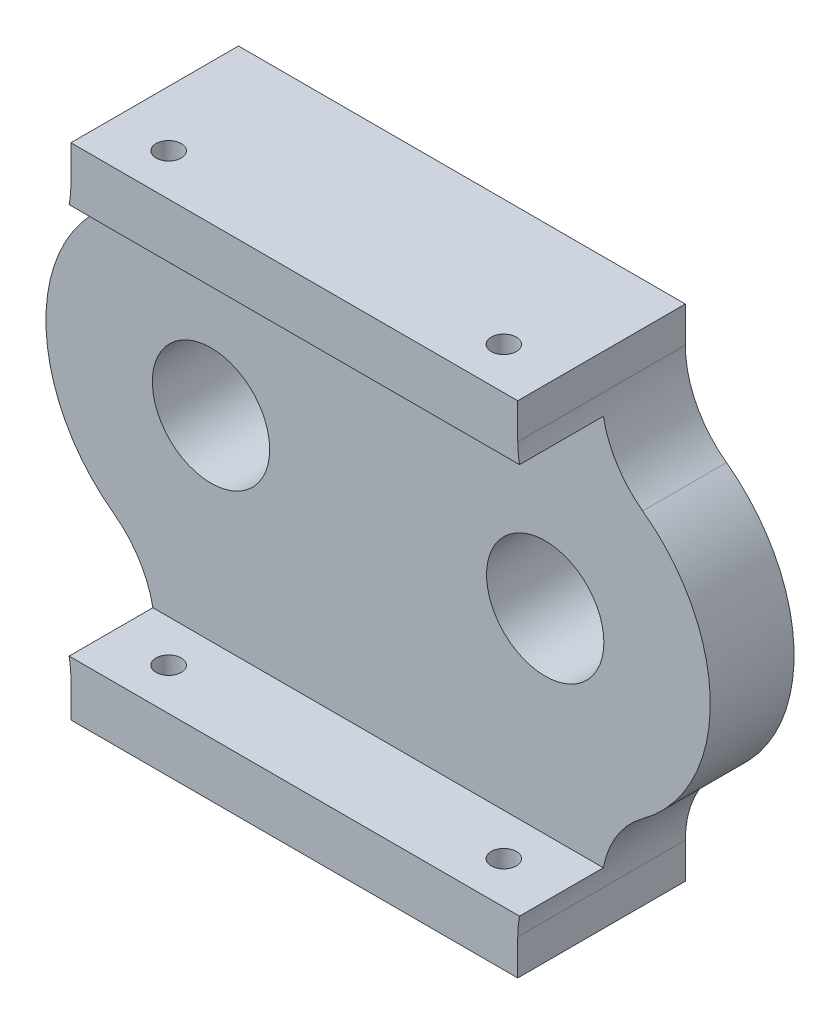
ISO-10303-21;
HEADER;
FILE_DESCRIPTION(('STEP AP214'),'2;1');
FILE_NAME('part.step','',(''),(''),'','','');
FILE_SCHEMA(('AUTOMOTIVE_DESIGN { 1 0 10303 214 1 1 1 1 }'));
ENDSEC;
DATA;
#1=APPLICATION_CONTEXT('core data for automotive mechanical design processes');
#2=APPLICATION_PROTOCOL_DEFINITION('international standard','automotive_design',2000,#1);
#3=PRODUCT_CONTEXT('',#1,'mechanical');
#4=PRODUCT('Part','Part','',(#3));
#5=PRODUCT_RELATED_PRODUCT_CATEGORY('part','',(#4));
#6=PRODUCT_DEFINITION_FORMATION('','',#4);
#7=PRODUCT_DEFINITION_CONTEXT('part definition',#1,'design');
#8=PRODUCT_DEFINITION('design','',#6,#7);
#9=PRODUCT_DEFINITION_SHAPE('','',#8);
#10=(LENGTH_UNIT() NAMED_UNIT(*) SI_UNIT(.MILLI.,.METRE.));
#11=(NAMED_UNIT(*) PLANE_ANGLE_UNIT() SI_UNIT($,.RADIAN.));
#12=(NAMED_UNIT(*) SI_UNIT($,.STERADIAN.) SOLID_ANGLE_UNIT());
#13=UNCERTAINTY_MEASURE_WITH_UNIT(LENGTH_MEASURE(1.E-05),#10,'distance_accuracy_value','');
#14=(GEOMETRIC_REPRESENTATION_CONTEXT(3) GLOBAL_UNCERTAINTY_ASSIGNED_CONTEXT((#13)) GLOBAL_UNIT_ASSIGNED_CONTEXT((#10,
#11,#12)) REPRESENTATION_CONTEXT('',''));
#15=CARTESIAN_POINT('',(0.,0.,0.));
#16=DIRECTION('',(0.,0.,1.));
#17=DIRECTION('',(1.,0.,0.));
#18=AXIS2_PLACEMENT_3D('',#15,#16,#17);
#19=CARTESIAN_POINT('',(-29.9162885534734,0.000305589560917769,15.));
#20=DIRECTION('',(0.,0.,-1.));
#21=DIRECTION('',(-1.,0.,0.));
#22=AXIS2_PLACEMENT_3D('',#19,#20,#21);
#23=CYLINDRICAL_SURFACE('',#22,10.4999999999879);
#24=CARTESIAN_POINT('',(-29.9162885534734,0.000305589560917769,15.));
#25=DIRECTION('',(0.,0.,1.));
#26=DIRECTION('',(1.,0.,0.));
#27=AXIS2_PLACEMENT_3D('',#24,#25,#26);
#28=CIRCLE('',#27,10.4999999999879);
#29=CARTESIAN_POINT('',(-19.4162885534855,0.000305589560917769,15.));
#30=VERTEX_POINT('',#29);
#31=EDGE_CURVE('E225',#30,#30,#28,.T.);
#32=ORIENTED_EDGE('',*,*,#31,.T.);
#33=EDGE_LOOP('',(#32));
#34=FACE_BOUND('',#33,.T.);
#35=CARTESIAN_POINT('',(-29.9162885534734,0.000305589560917769,0.));
#36=DIRECTION('',(0.,0.,1.));
#37=DIRECTION('',(1.,0.,0.));
#38=AXIS2_PLACEMENT_3D('',#35,#36,#37);
#39=CIRCLE('',#38,10.4999999999879);
#40=CARTESIAN_POINT('',(-19.4162885534855,0.000305589560917769,0.));
#41=VERTEX_POINT('',#40);
#42=EDGE_CURVE('E249',#41,#41,#39,.T.);
#43=ORIENTED_EDGE('',*,*,#42,.F.);
#44=EDGE_LOOP('',(#43));
#45=FACE_BOUND('',#44,.T.);
#46=ADVANCED_FACE('F134',(#34,#45),#23,.F.);
#47=CARTESIAN_POINT('',(-58.0000000000002,38.3771628916933,15.));
#48=DIRECTION('',(0.,0.,-1.));
#49=DIRECTION('',(-1.,0.,0.));
#50=AXIS2_PLACEMENT_3D('',#47,#48,#49);
#51=CYLINDRICAL_SURFACE('',#50,18.);
#52=CARTESIAN_POINT('',(-58.0000000000002,38.3771628916933,0.));
#53=DIRECTION('',(0.,0.,1.));
#54=DIRECTION('',(1.,0.,0.));
#55=AXIS2_PLACEMENT_3D('',#52,#53,#54);
#56=CIRCLE('',#55,18.);
#57=CARTESIAN_POINT('',(-47.370059803649,23.8511733755881,0.));
#58=VERTEX_POINT('',#57);
#59=CARTESIAN_POINT('',(-40.,38.3771628916932,0.));
#60=VERTEX_POINT('',#59);
#61=EDGE_CURVE('E234',#58,#60,#56,.T.);
#62=ORIENTED_EDGE('',*,*,#61,.F.);
#63=DIRECTION('',(0.,0.,-1.));
#64=VECTOR('',#63,1.);
#65=CARTESIAN_POINT('',(-47.370059803649,23.8511733755881,15.));
#66=LINE('',#65,#64);
#67=CARTESIAN_POINT('',(-47.370059803649,23.8511733755881,15.));
#68=VERTEX_POINT('',#67);
#69=EDGE_CURVE('E12',#68,#58,#66,.T.);
#70=ORIENTED_EDGE('',*,*,#69,.F.);
#71=CARTESIAN_POINT('',(-58.0000000000002,38.3771628916933,15.));
#72=DIRECTION('',(0.,0.,1.));
#73=DIRECTION('',(1.,0.,0.));
#74=AXIS2_PLACEMENT_3D('',#71,#72,#73);
#75=CIRCLE('',#74,18.);
#76=CARTESIAN_POINT('',(-40.3196501504358,35.0000000000036,15.));
#77=VERTEX_POINT('',#76);
#78=EDGE_CURVE('E366',#68,#77,#75,.T.);
#79=ORIENTED_EDGE('',*,*,#78,.T.);
#80=DIRECTION('',(0.,0.,-1.));
#81=VECTOR('',#80,1.);
#82=CARTESIAN_POINT('',(-40.3196501504358,35.0000000000036,30.));
#83=LINE('',#82,#81);
#84=CARTESIAN_POINT('',(-40.3196501504358,35.0000000000036,30.));
#85=VERTEX_POINT('',#84);
#86=EDGE_CURVE('E184',#85,#77,#83,.T.);
#87=ORIENTED_EDGE('',*,*,#86,.F.);
#88=CARTESIAN_POINT('',(-58.0000000000001,38.3771628916932,30.));
#89=DIRECTION('',(0.,0.,1.));
#90=DIRECTION('',(1.,0.,0.));
#91=AXIS2_PLACEMENT_3D('',#88,#89,#90);
#92=CIRCLE('',#91,18.0000000000001);
#93=CARTESIAN_POINT('',(-40.,38.3771628916932,30.));
#94=VERTEX_POINT('',#93);
#95=EDGE_CURVE('E322',#85,#94,#92,.T.);
#96=ORIENTED_EDGE('',*,*,#95,.T.);
#97=DIRECTION('',(0.,0.,-1.));
#98=VECTOR('',#97,1.);
#99=CARTESIAN_POINT('',(-40.,38.3771628916932,30.));
#100=LINE('',#99,#98);
#101=EDGE_CURVE('E340',#94,#60,#100,.T.);
#102=ORIENTED_EDGE('',*,*,#101,.T.);
#103=EDGE_LOOP('',(#62,#70,#79,#87,#96,#102));
#104=FACE_BOUND('',#103,.T.);
#105=ADVANCED_FACE('F429',(#104),#51,.F.);
#106=CARTESIAN_POINT('',(-29.9162885534735,0.000305589560940835,15.));
#107=DIRECTION('',(0.,0.,-1.));
#108=DIRECTION('',(-1.,0.,0.));
#109=AXIS2_PLACEMENT_3D('',#106,#107,#108);
#110=CYLINDRICAL_SURFACE('',#109,29.555);
#111=CARTESIAN_POINT('',(-29.9162885534735,0.000305589560940835,0.));
#112=DIRECTION('',(0.,0.,1.));
#113=DIRECTION('',(1.,0.,0.));
#114=AXIS2_PLACEMENT_3D('',#111,#112,#113);
#115=CIRCLE('',#114,29.555);
#116=CARTESIAN_POINT('',(-47.370059803649,-23.8505621964662,0.));
#117=VERTEX_POINT('',#116);
#118=EDGE_CURVE('E238',#58,#117,#115,.T.);
#119=ORIENTED_EDGE('',*,*,#118,.T.);
#120=DIRECTION('',(0.,0.,-1.));
#121=VECTOR('',#120,1.);
#122=CARTESIAN_POINT('',(-47.370059803649,-23.8505621964662,15.));
#123=LINE('',#122,#121);
#124=CARTESIAN_POINT('',(-47.370059803649,-23.8505621964662,15.));
#125=VERTEX_POINT('',#124);
#126=EDGE_CURVE('E144',#125,#117,#123,.T.);
#127=ORIENTED_EDGE('',*,*,#126,.F.);
#128=CARTESIAN_POINT('',(-29.9162885534735,0.000305589560940835,15.));
#129=DIRECTION('',(0.,0.,1.));
#130=DIRECTION('',(1.,0.,0.));
#131=AXIS2_PLACEMENT_3D('',#128,#129,#130);
#132=CIRCLE('',#131,29.555);
#133=EDGE_CURVE('E369',#68,#125,#132,.T.);
#134=ORIENTED_EDGE('',*,*,#133,.F.);
#135=ORIENTED_EDGE('',*,*,#69,.T.);
#136=EDGE_LOOP('',(#119,#127,#134,#135));
#137=FACE_BOUND('',#136,.T.);
#138=ADVANCED_FACE('F452',(#137),#110,.T.);
#139=CARTESIAN_POINT('',(-58.0000000000002,-38.3765517125714,15.));
#140=DIRECTION('',(0.,0.,-1.));
#141=DIRECTION('',(-1.,0.,0.));
#142=AXIS2_PLACEMENT_3D('',#139,#140,#141);
#143=CYLINDRICAL_SURFACE('',#142,18.);
#144=CARTESIAN_POINT('',(-58.0000000000002,-38.3765517125714,0.));
#145=DIRECTION('',(0.,0.,1.));
#146=DIRECTION('',(1.,0.,0.));
#147=AXIS2_PLACEMENT_3D('',#144,#145,#146);
#148=CIRCLE('',#147,18.);
#149=CARTESIAN_POINT('',(-40.0000000000001,-38.3765517125714,0.));
#150=VERTEX_POINT('',#149);
#151=EDGE_CURVE('E241',#150,#117,#148,.T.);
#152=ORIENTED_EDGE('',*,*,#151,.F.);
#153=DIRECTION('',(0.,0.,-1.));
#154=VECTOR('',#153,1.);
#155=CARTESIAN_POINT('',(-40.0000000000001,-38.3765517125714,30.));
#156=LINE('',#155,#154);
#157=CARTESIAN_POINT('',(-40.0000000000001,-38.3765517125714,30.));
#158=VERTEX_POINT('',#157);
#159=EDGE_CURVE('E318',#158,#150,#156,.T.);
#160=ORIENTED_EDGE('',*,*,#159,.F.);
#161=CARTESIAN_POINT('',(-58.0000000000001,-38.3765517125714,30.));
#162=DIRECTION('',(0.,0.,1.));
#163=DIRECTION('',(1.,0.,0.));
#164=AXIS2_PLACEMENT_3D('',#161,#162,#163);
#165=CIRCLE('',#164,18.);
#166=CARTESIAN_POINT('',(-40.3195334187048,-34.9999999999958,30.));
#167=VERTEX_POINT('',#166);
#168=EDGE_CURVE('E290',#158,#167,#165,.T.);
#169=ORIENTED_EDGE('',*,*,#168,.T.);
#170=DIRECTION('',(0.,0.,-1.));
#171=VECTOR('',#170,1.);
#172=CARTESIAN_POINT('',(-40.3195334187048,-34.9999999999958,30.));
#173=LINE('',#172,#171);
#174=CARTESIAN_POINT('',(-40.3195334187048,-34.9999999999958,15.));
#175=VERTEX_POINT('',#174);
#176=EDGE_CURVE('E213',#167,#175,#173,.T.);
#177=ORIENTED_EDGE('',*,*,#176,.T.);
#178=CARTESIAN_POINT('',(-58.0000000000002,-38.3765517125714,15.));
#179=DIRECTION('',(0.,0.,1.));
#180=DIRECTION('',(1.,0.,0.));
#181=AXIS2_PLACEMENT_3D('',#178,#179,#180);
#182=CIRCLE('',#181,18.);
#183=EDGE_CURVE('E220',#175,#125,#182,.T.);
#184=ORIENTED_EDGE('',*,*,#183,.T.);
#185=ORIENTED_EDGE('',*,*,#126,.T.);
#186=EDGE_LOOP('',(#152,#160,#169,#177,#184,#185));
#187=FACE_BOUND('',#186,.T.);
#188=ADVANCED_FACE('F372',(#187),#143,.F.);
#189=CARTESIAN_POINT('',(57.9999999999998,-38.3765517125713,15.));
#190=DIRECTION('',(0.,0.,-1.));
#191=DIRECTION('',(-1.,0.,0.));
#192=AXIS2_PLACEMENT_3D('',#189,#190,#191);
#193=CYLINDRICAL_SURFACE('',#192,18.);
#194=CARTESIAN_POINT('',(57.9999999999998,-38.3765517125713,0.));
#195=DIRECTION('',(0.,0.,1.));
#196=DIRECTION('',(1.,0.,0.));
#197=AXIS2_PLACEMENT_3D('',#194,#195,#196);
#198=CIRCLE('',#197,18.);
#199=CARTESIAN_POINT('',(47.3700598036488,-23.8505621964662,0.));
#200=VERTEX_POINT('',#199);
#201=CARTESIAN_POINT('',(39.9999999999999,-38.3765517125714,0.));
#202=VERTEX_POINT('',#201);
#203=EDGE_CURVE('E244',#200,#202,#198,.T.);
#204=ORIENTED_EDGE('',*,*,#203,.F.);
#205=DIRECTION('',(0.,0.,-1.));
#206=VECTOR('',#205,1.);
#207=CARTESIAN_POINT('',(47.3700598036488,-23.8505621964662,15.));
#208=LINE('',#207,#206);
#209=CARTESIAN_POINT('',(47.3700598036488,-23.8505621964662,15.));
#210=VERTEX_POINT('',#209);
#211=EDGE_CURVE('E169',#210,#200,#208,.T.);
#212=ORIENTED_EDGE('',*,*,#211,.F.);
#213=CARTESIAN_POINT('',(57.9999999999998,-38.3765517125713,15.));
#214=DIRECTION('',(0.,0.,1.));
#215=DIRECTION('',(1.,0.,0.));
#216=AXIS2_PLACEMENT_3D('',#213,#214,#215);
#217=CIRCLE('',#216,18.);
#218=CARTESIAN_POINT('',(40.3195334187044,-34.9999999999964,15.));
#219=VERTEX_POINT('',#218);
#220=EDGE_CURVE('E218',#210,#219,#217,.T.);
#221=ORIENTED_EDGE('',*,*,#220,.T.);
#222=DIRECTION('',(0.,0.,-1.));
#223=VECTOR('',#222,1.);
#224=CARTESIAN_POINT('',(40.3195334187044,-34.9999999999964,30.));
#225=LINE('',#224,#223);
#226=CARTESIAN_POINT('',(40.3195334187044,-34.9999999999964,30.));
#227=VERTEX_POINT('',#226);
#228=EDGE_CURVE('E198',#227,#219,#225,.T.);
#229=ORIENTED_EDGE('',*,*,#228,.F.);
#230=CARTESIAN_POINT('',(58.,-38.3765517125714,30.));
#231=DIRECTION('',(0.,0.,1.));
#232=DIRECTION('',(1.,0.,0.));
#233=AXIS2_PLACEMENT_3D('',#230,#231,#232);
#234=CIRCLE('',#233,18.0000000000001);
#235=CARTESIAN_POINT('',(39.9999999999999,-38.3765517125714,30.));
#236=VERTEX_POINT('',#235);
#237=EDGE_CURVE('E286',#227,#236,#234,.T.);
#238=ORIENTED_EDGE('',*,*,#237,.T.);
#239=DIRECTION('',(0.,0.,-1.));
#240=VECTOR('',#239,1.);
#241=CARTESIAN_POINT('',(39.9999999999999,-38.3765517125714,30.));
#242=LINE('',#241,#240);
#243=EDGE_CURVE('E302',#236,#202,#242,.T.);
#244=ORIENTED_EDGE('',*,*,#243,.T.);
#245=EDGE_LOOP('',(#204,#212,#221,#229,#238,#244));
#246=FACE_BOUND('',#245,.T.);
#247=ADVANCED_FACE('F223',(#246),#193,.F.);
#248=CARTESIAN_POINT('',(29.9162885534731,0.000305589560940835,15.));
#249=DIRECTION('',(0.,0.,-1.));
#250=DIRECTION('',(-1.,0.,0.));
#251=AXIS2_PLACEMENT_3D('',#248,#249,#250);
#252=CYLINDRICAL_SURFACE('',#251,29.5550000000002);
#253=CARTESIAN_POINT('',(29.9162885534731,0.000305589560940835,0.));
#254=DIRECTION('',(0.,0.,1.));
#255=DIRECTION('',(1.,0.,0.));
#256=AXIS2_PLACEMENT_3D('',#253,#254,#255);
#257=CIRCLE('',#256,29.5550000000002);
#258=CARTESIAN_POINT('',(47.3700598036488,23.8511733755882,0.));
#259=VERTEX_POINT('',#258);
#260=EDGE_CURVE('E247',#200,#259,#257,.T.);
#261=ORIENTED_EDGE('',*,*,#260,.T.);
#262=DIRECTION('',(0.,0.,-1.));
#263=VECTOR('',#262,1.);
#264=CARTESIAN_POINT('',(47.3700598036488,23.8511733755882,15.));
#265=LINE('',#264,#263);
#266=CARTESIAN_POINT('',(47.3700598036488,23.8511733755882,15.));
#267=VERTEX_POINT('',#266);
#268=EDGE_CURVE('E176',#267,#259,#265,.T.);
#269=ORIENTED_EDGE('',*,*,#268,.F.);
#270=CARTESIAN_POINT('',(29.9162885534731,0.000305589560940835,15.));
#271=DIRECTION('',(0.,0.,1.));
#272=DIRECTION('',(1.,0.,0.));
#273=AXIS2_PLACEMENT_3D('',#270,#271,#272);
#274=CIRCLE('',#273,29.5550000000002);
#275=EDGE_CURVE('E153',#210,#267,#274,.T.);
#276=ORIENTED_EDGE('',*,*,#275,.F.);
#277=ORIENTED_EDGE('',*,*,#211,.T.);
#278=EDGE_LOOP('',(#261,#269,#276,#277));
#279=FACE_BOUND('',#278,.T.);
#280=ADVANCED_FACE('F467',(#279),#252,.T.);
#281=CARTESIAN_POINT('',(58.0000000000003,38.3771628916933,15.));
#282=DIRECTION('',(0.,0.,-1.));
#283=DIRECTION('',(-1.,0.,0.));
#284=AXIS2_PLACEMENT_3D('',#281,#282,#283);
#285=CYLINDRICAL_SURFACE('',#284,18.0000000000003);
#286=CARTESIAN_POINT('',(58.0000000000003,38.3771628916933,0.));
#287=DIRECTION('',(0.,0.,1.));
#288=DIRECTION('',(1.,0.,0.));
#289=AXIS2_PLACEMENT_3D('',#286,#287,#288);
#290=CIRCLE('',#289,18.0000000000003);
#291=CARTESIAN_POINT('',(39.9999999999998,38.3771628916932,0.));
#292=VERTEX_POINT('',#291);
#293=EDGE_CURVE('E231',#292,#259,#290,.T.);
#294=ORIENTED_EDGE('',*,*,#293,.F.);
#295=DIRECTION('',(0.,0.,-1.));
#296=VECTOR('',#295,1.);
#297=CARTESIAN_POINT('',(39.9999999999998,38.3771628916932,30.));
#298=LINE('',#297,#296);
#299=CARTESIAN_POINT('',(39.9999999999998,38.3771628916932,30.));
#300=VERTEX_POINT('',#299);
#301=EDGE_CURVE('E356',#300,#292,#298,.T.);
#302=ORIENTED_EDGE('',*,*,#301,.F.);
#303=CARTESIAN_POINT('',(58.,38.3771628916932,30.));
#304=DIRECTION('',(0.,0.,1.));
#305=DIRECTION('',(1.,0.,0.));
#306=AXIS2_PLACEMENT_3D('',#303,#304,#305);
#307=CIRCLE('',#306,18.0000000000001);
#308=CARTESIAN_POINT('',(40.3196501504353,35.0000000000042,30.));
#309=VERTEX_POINT('',#308);
#310=EDGE_CURVE('E328',#300,#309,#307,.T.);
#311=ORIENTED_EDGE('',*,*,#310,.T.);
#312=DIRECTION('',(0.,0.,-1.));
#313=VECTOR('',#312,1.);
#314=CARTESIAN_POINT('',(40.3196501504353,35.0000000000042,30.));
#315=LINE('',#314,#313);
#316=CARTESIAN_POINT('',(40.3196501504353,35.0000000000042,15.));
#317=VERTEX_POINT('',#316);
#318=EDGE_CURVE('E359',#309,#317,#315,.T.);
#319=ORIENTED_EDGE('',*,*,#318,.T.);
#320=CARTESIAN_POINT('',(58.0000000000003,38.3771628916933,15.));
#321=DIRECTION('',(0.,0.,1.));
#322=DIRECTION('',(1.,0.,0.));
#323=AXIS2_PLACEMENT_3D('',#320,#321,#322);
#324=CIRCLE('',#323,18.0000000000003);
#325=EDGE_CURVE('E252',#317,#267,#324,.T.);
#326=ORIENTED_EDGE('',*,*,#325,.T.);
#327=ORIENTED_EDGE('',*,*,#268,.T.);
#328=EDGE_LOOP('',(#294,#302,#311,#319,#326,#327));
#329=FACE_BOUND('',#328,.T.);
#330=ADVANCED_FACE('F444',(#329),#285,.F.);
#331=CARTESIAN_POINT('',(0.,0.,0.));
#332=DIRECTION('',(0.,0.,1.));
#333=DIRECTION('',(1.,0.,0.));
#334=AXIS2_PLACEMENT_3D('',#331,#332,#333);
#335=PLANE('',#334);
#336=ORIENTED_EDGE('',*,*,#293,.T.);
#337=ORIENTED_EDGE('',*,*,#260,.F.);
#338=ORIENTED_EDGE('',*,*,#203,.T.);
#339=DIRECTION('',(0.,1.,0.));
#340=VECTOR('',#339,1.);
#341=CARTESIAN_POINT('',(39.9999999999999,0.,0.));
#342=LINE('',#341,#340);
#343=CARTESIAN_POINT('',(39.9999999999999,-44.75,0.));
#344=VERTEX_POINT('',#343);
#345=EDGE_CURVE('E288',#344,#202,#342,.T.);
#346=ORIENTED_EDGE('',*,*,#345,.F.);
#347=DIRECTION('',(1.,0.,0.));
#348=VECTOR('',#347,1.);
#349=CARTESIAN_POINT('',(0.,-44.75,0.));
#350=LINE('',#349,#348);
#351=CARTESIAN_POINT('',(-40.0000000000001,-44.75,0.));
#352=VERTEX_POINT('',#351);
#353=EDGE_CURVE('E305',#352,#344,#350,.T.);
#354=ORIENTED_EDGE('',*,*,#353,.F.);
#355=DIRECTION('',(0.,-1.,0.));
#356=VECTOR('',#355,1.);
#357=CARTESIAN_POINT('',(-40.,1.30646273558267E-13,0.));
#358=LINE('',#357,#356);
#359=EDGE_CURVE('E285',#150,#352,#358,.T.);
#360=ORIENTED_EDGE('',*,*,#359,.F.);
#361=ORIENTED_EDGE('',*,*,#151,.T.);
#362=ORIENTED_EDGE('',*,*,#118,.F.);
#363=ORIENTED_EDGE('',*,*,#61,.T.);
#364=DIRECTION('',(0.,-1.,0.));
#365=VECTOR('',#364,1.);
#366=CARTESIAN_POINT('',(-40.,0.,0.));
#367=LINE('',#366,#365);
#368=CARTESIAN_POINT('',(-40.,44.75,0.));
#369=VERTEX_POINT('',#368);
#370=EDGE_CURVE('E326',#369,#60,#367,.T.);
#371=ORIENTED_EDGE('',*,*,#370,.F.);
#372=DIRECTION('',(-1.,0.,0.));
#373=VECTOR('',#372,1.);
#374=CARTESIAN_POINT('',(0.,44.75,0.));
#375=LINE('',#374,#373);
#376=CARTESIAN_POINT('',(39.9999999999998,44.75,0.));
#377=VERTEX_POINT('',#376);
#378=EDGE_CURVE('E343',#377,#369,#375,.T.);
#379=ORIENTED_EDGE('',*,*,#378,.F.);
#380=DIRECTION('',(0.,1.,0.));
#381=VECTOR('',#380,1.);
#382=CARTESIAN_POINT('',(39.9999999999998,0.,0.));
#383=LINE('',#382,#381);
#384=EDGE_CURVE('E212',#292,#377,#383,.T.);
#385=ORIENTED_EDGE('',*,*,#384,.F.);
#386=EDGE_LOOP('',(#336,#337,#338,#346,#354,#360,#361,#362,#363,#371,#379,#385));
#387=FACE_BOUND('',#386,.T.);
#388=ORIENTED_EDGE('',*,*,#42,.T.);
#389=EDGE_LOOP('',(#388));
#390=FACE_BOUND('',#389,.T.);
#391=CARTESIAN_POINT('',(29.9162885534732,0.000305589560917769,0.));
#392=DIRECTION('',(0.,0.,1.));
#393=DIRECTION('',(1.,0.,0.));
#394=AXIS2_PLACEMENT_3D('',#391,#392,#393);
#395=CIRCLE('',#394,10.4999999999975);
#396=CARTESIAN_POINT('',(40.4162885534707,0.000305589560917769,0.));
#397=VERTEX_POINT('',#396);
#398=EDGE_CURVE('E258',#397,#397,#395,.T.);
#399=ORIENTED_EDGE('',*,*,#398,.T.);
#400=EDGE_LOOP('',(#399));
#401=FACE_BOUND('',#400,.T.);
#402=ADVANCED_FACE('F424',(#387,#390,#401),#335,.F.);
#403=CARTESIAN_POINT('',(0.,0.,15.));
#404=DIRECTION('',(0.,0.,1.));
#405=DIRECTION('',(1.,0.,0.));
#406=AXIS2_PLACEMENT_3D('',#403,#404,#405);
#407=PLANE('',#406);
#408=ORIENTED_EDGE('',*,*,#325,.F.);
#409=DIRECTION('',(-1.,0.,0.));
#410=VECTOR('',#409,1.);
#411=CARTESIAN_POINT('',(-2.59006099666486E-13,35.0000000000039,15.));
#412=LINE('',#411,#410);
#413=EDGE_CURVE('E364',#317,#77,#412,.T.);
#414=ORIENTED_EDGE('',*,*,#413,.T.);
#415=ORIENTED_EDGE('',*,*,#78,.F.);
#416=ORIENTED_EDGE('',*,*,#133,.T.);
#417=ORIENTED_EDGE('',*,*,#183,.F.);
#418=DIRECTION('',(1.,0.,0.));
#419=VECTOR('',#418,1.);
#420=CARTESIAN_POINT('',(-2.62018557084706E-13,-34.9999999999961,15.));
#421=LINE('',#420,#419);
#422=EDGE_CURVE('E203',#175,#219,#421,.T.);
#423=ORIENTED_EDGE('',*,*,#422,.T.);
#424=ORIENTED_EDGE('',*,*,#220,.F.);
#425=ORIENTED_EDGE('',*,*,#275,.T.);
#426=EDGE_LOOP('',(#408,#414,#415,#416,#417,#423,#424,#425));
#427=FACE_BOUND('',#426,.T.);
#428=ORIENTED_EDGE('',*,*,#31,.F.);
#429=EDGE_LOOP('',(#428));
#430=FACE_BOUND('',#429,.T.);
#431=CARTESIAN_POINT('',(29.9162885534732,0.000305589560917769,15.));
#432=DIRECTION('',(0.,0.,1.));
#433=DIRECTION('',(1.,0.,0.));
#434=AXIS2_PLACEMENT_3D('',#431,#432,#433);
#435=CIRCLE('',#434,10.4999999999975);
#436=CARTESIAN_POINT('',(40.4162885534707,0.000305589560917769,15.));
#437=VERTEX_POINT('',#436);
#438=EDGE_CURVE('E235',#437,#437,#435,.T.);
#439=ORIENTED_EDGE('',*,*,#438,.F.);
#440=EDGE_LOOP('',(#439));
#441=FACE_BOUND('',#440,.T.);
#442=ADVANCED_FACE('F216',(#427,#430,#441),#407,.T.);
#443=CARTESIAN_POINT('',(29.9162885534732,0.000305589560917769,15.));
#444=DIRECTION('',(0.,0.,-1.));
#445=DIRECTION('',(-1.,0.,0.));
#446=AXIS2_PLACEMENT_3D('',#443,#444,#445);
#447=CYLINDRICAL_SURFACE('',#446,10.4999999999975);
#448=ORIENTED_EDGE('',*,*,#438,.T.);
#449=EDGE_LOOP('',(#448));
#450=FACE_BOUND('',#449,.T.);
#451=ORIENTED_EDGE('',*,*,#398,.F.);
#452=EDGE_LOOP('',(#451));
#453=FACE_BOUND('',#452,.T.);
#454=ADVANCED_FACE('F136',(#450,#453),#447,.F.);
#455=CARTESIAN_POINT('',(-2.59006099666486E-13,35.0000000000039,30.));
#456=DIRECTION('',(0.,-1.,0.));
#457=DIRECTION('',(1.,0.,0.));
#458=AXIS2_PLACEMENT_3D('',#455,#456,#457);
#459=PLANE('',#458);
#460=CARTESIAN_POINT('',(-30.0012885534735,35.0000000000037,22.5));
#461=DIRECTION('',(0.,-1.,0.));
#462=DIRECTION('',(1.,0.,0.));
#463=AXIS2_PLACEMENT_3D('',#460,#461,#462);
#464=CIRCLE('',#463,2.25);
#465=CARTESIAN_POINT('',(-27.7512885534735,35.0000000000037,22.5));
#466=VERTEX_POINT('',#465);
#467=EDGE_CURVE('E282',#466,#466,#464,.T.);
#468=ORIENTED_EDGE('',*,*,#467,.F.);
#469=EDGE_LOOP('',(#468));
#470=FACE_BOUND('',#469,.T.);
#471=CARTESIAN_POINT('',(30.0012885534735,35.0000000000041,22.5000000000009));
#472=DIRECTION('',(0.,-1.,0.));
#473=DIRECTION('',(1.,0.,0.));
#474=AXIS2_PLACEMENT_3D('',#471,#472,#473);
#475=CIRCLE('',#474,2.25);
#476=CARTESIAN_POINT('',(32.2512885534735,35.0000000000041,22.5000000000009));
#477=VERTEX_POINT('',#476);
#478=EDGE_CURVE('E267',#477,#477,#475,.T.);
#479=ORIENTED_EDGE('',*,*,#478,.F.);
#480=EDGE_LOOP('',(#479));
#481=FACE_BOUND('',#480,.T.);
#482=ORIENTED_EDGE('',*,*,#413,.F.);
#483=ORIENTED_EDGE('',*,*,#318,.F.);
#484=DIRECTION('',(-1.,0.,0.));
#485=VECTOR('',#484,1.);
#486=CARTESIAN_POINT('',(-2.59006099666486E-13,35.0000000000039,30.));
#487=LINE('',#486,#485);
#488=EDGE_CURVE('E325',#309,#85,#487,.T.);
#489=ORIENTED_EDGE('',*,*,#488,.T.);
#490=ORIENTED_EDGE('',*,*,#86,.T.);
#491=EDGE_LOOP('',(#482,#483,#489,#490));
#492=FACE_BOUND('',#491,.T.);
#493=ADVANCED_FACE('F448',(#470,#481,#492),#459,.T.);
#494=CARTESIAN_POINT('',(39.9999999999998,0.,30.));
#495=DIRECTION('',(-1.,0.,0.));
#496=DIRECTION('',(0.,0.,1.));
#497=AXIS2_PLACEMENT_3D('',#494,#495,#496);
#498=PLANE('',#497);
#499=ORIENTED_EDGE('',*,*,#384,.T.);
#500=DIRECTION('',(0.,0.,-1.));
#501=VECTOR('',#500,1.);
#502=CARTESIAN_POINT('',(39.9999999999998,44.75,30.));
#503=LINE('',#502,#501);
#504=CARTESIAN_POINT('',(39.9999999999998,44.75,30.));
#505=VERTEX_POINT('',#504);
#506=EDGE_CURVE('E353',#505,#377,#503,.T.);
#507=ORIENTED_EDGE('',*,*,#506,.F.);
#508=DIRECTION('',(0.,1.,0.));
#509=VECTOR('',#508,1.);
#510=CARTESIAN_POINT('',(39.9999999999998,0.,30.));
#511=LINE('',#510,#509);
#512=EDGE_CURVE('E331',#300,#505,#511,.T.);
#513=ORIENTED_EDGE('',*,*,#512,.F.);
#514=ORIENTED_EDGE('',*,*,#301,.T.);
#515=EDGE_LOOP('',(#499,#507,#513,#514));
#516=FACE_BOUND('',#515,.T.);
#517=ADVANCED_FACE('F441',(#516),#498,.F.);
#518=CARTESIAN_POINT('',(0.,44.75,30.));
#519=DIRECTION('',(0.,-1.,0.));
#520=DIRECTION('',(0.,0.,-1.));
#521=AXIS2_PLACEMENT_3D('',#518,#519,#520);
#522=PLANE('',#521);
#523=CARTESIAN_POINT('',(-30.0012885534735,44.75,22.5));
#524=DIRECTION('',(0.,-1.,0.));
#525=DIRECTION('',(0.,0.,-1.));
#526=AXIS2_PLACEMENT_3D('',#523,#524,#525);
#527=CIRCLE('',#526,2.25);
#528=CARTESIAN_POINT('',(-30.0012885534735,44.75,20.25));
#529=VERTEX_POINT('',#528);
#530=EDGE_CURVE('E263',#529,#529,#527,.T.);
#531=ORIENTED_EDGE('',*,*,#530,.T.);
#532=EDGE_LOOP('',(#531));
#533=FACE_BOUND('',#532,.T.);
#534=CARTESIAN_POINT('',(30.0012885534735,44.75,22.5000000000009));
#535=DIRECTION('',(0.,-1.,0.));
#536=DIRECTION('',(0.,0.,1.));
#537=AXIS2_PLACEMENT_3D('',#534,#535,#536);
#538=CIRCLE('',#537,2.25);
#539=CARTESIAN_POINT('',(30.0012885534735,44.75,24.7500000000009));
#540=VERTEX_POINT('',#539);
#541=EDGE_CURVE('E270',#540,#540,#538,.T.);
#542=ORIENTED_EDGE('',*,*,#541,.T.);
#543=EDGE_LOOP('',(#542));
#544=FACE_BOUND('',#543,.T.);
#545=ORIENTED_EDGE('',*,*,#378,.T.);
#546=DIRECTION('',(0.,0.,-1.));
#547=VECTOR('',#546,1.);
#548=CARTESIAN_POINT('',(-40.,44.75,30.));
#549=LINE('',#548,#547);
#550=CARTESIAN_POINT('',(-40.,44.75,30.));
#551=VERTEX_POINT('',#550);
#552=EDGE_CURVE('E350',#551,#369,#549,.T.);
#553=ORIENTED_EDGE('',*,*,#552,.F.);
#554=DIRECTION('',(-1.,0.,0.));
#555=VECTOR('',#554,1.);
#556=CARTESIAN_POINT('',(0.,44.75,30.));
#557=LINE('',#556,#555);
#558=EDGE_CURVE('E334',#505,#551,#557,.T.);
#559=ORIENTED_EDGE('',*,*,#558,.F.);
#560=ORIENTED_EDGE('',*,*,#506,.T.);
#561=EDGE_LOOP('',(#545,#553,#559,#560));
#562=FACE_BOUND('',#561,.T.);
#563=ADVANCED_FACE('F437',(#533,#544,#562),#522,.F.);
#564=CARTESIAN_POINT('',(-40.,0.,30.));
#565=DIRECTION('',(1.,0.,0.));
#566=DIRECTION('',(0.,0.,-1.));
#567=AXIS2_PLACEMENT_3D('',#564,#565,#566);
#568=PLANE('',#567);
#569=ORIENTED_EDGE('',*,*,#370,.T.);
#570=ORIENTED_EDGE('',*,*,#101,.F.);
#571=DIRECTION('',(0.,-1.,0.));
#572=VECTOR('',#571,1.);
#573=CARTESIAN_POINT('',(-40.,0.,30.));
#574=LINE('',#573,#572);
#575=EDGE_CURVE('E337',#551,#94,#574,.T.);
#576=ORIENTED_EDGE('',*,*,#575,.F.);
#577=ORIENTED_EDGE('',*,*,#552,.T.);
#578=EDGE_LOOP('',(#569,#570,#576,#577));
#579=FACE_BOUND('',#578,.T.);
#580=ADVANCED_FACE('F433',(#579),#568,.F.);
#581=CARTESIAN_POINT('',(0.,0.,30.));
#582=DIRECTION('',(0.,0.,1.));
#583=DIRECTION('',(1.,0.,0.));
#584=AXIS2_PLACEMENT_3D('',#581,#582,#583);
#585=PLANE('',#584);
#586=ORIENTED_EDGE('',*,*,#95,.F.);
#587=ORIENTED_EDGE('',*,*,#488,.F.);
#588=ORIENTED_EDGE('',*,*,#310,.F.);
#589=ORIENTED_EDGE('',*,*,#512,.T.);
#590=ORIENTED_EDGE('',*,*,#558,.T.);
#591=ORIENTED_EDGE('',*,*,#575,.T.);
#592=EDGE_LOOP('',(#586,#587,#588,#589,#590,#591));
#593=FACE_BOUND('',#592,.T.);
#594=ADVANCED_FACE('F447',(#593),#585,.T.);
#595=CARTESIAN_POINT('',(-2.62018557084706E-13,-34.9999999999961,30.));
#596=DIRECTION('',(0.,1.,0.));
#597=DIRECTION('',(-1.,0.,0.));
#598=AXIS2_PLACEMENT_3D('',#595,#596,#597);
#599=PLANE('',#598);
#600=CARTESIAN_POINT('',(-30.0012885534735,-34.9999999999959,22.5));
#601=DIRECTION('',(0.,1.,0.));
#602=DIRECTION('',(-1.,0.,0.));
#603=AXIS2_PLACEMENT_3D('',#600,#601,#602);
#604=CIRCLE('',#603,2.25);
#605=CARTESIAN_POINT('',(-32.2512885534735,-34.9999999999959,22.5));
#606=VERTEX_POINT('',#605);
#607=EDGE_CURVE('E279',#606,#606,#604,.T.);
#608=ORIENTED_EDGE('',*,*,#607,.F.);
#609=EDGE_LOOP('',(#608));
#610=FACE_BOUND('',#609,.T.);
#611=CARTESIAN_POINT('',(30.0012885534735,-34.9999999999963,22.5000000000009));
#612=DIRECTION('',(0.,1.,0.));
#613=DIRECTION('',(-1.,0.,0.));
#614=AXIS2_PLACEMENT_3D('',#611,#612,#613);
#615=CIRCLE('',#614,2.25);
#616=CARTESIAN_POINT('',(27.7512885534735,-34.9999999999963,22.5000000000009));
#617=VERTEX_POINT('',#616);
#618=EDGE_CURVE('E262',#617,#617,#615,.T.);
#619=ORIENTED_EDGE('',*,*,#618,.F.);
#620=EDGE_LOOP('',(#619));
#621=FACE_BOUND('',#620,.T.);
#622=ORIENTED_EDGE('',*,*,#422,.F.);
#623=ORIENTED_EDGE('',*,*,#176,.F.);
#624=DIRECTION('',(1.,0.,0.));
#625=VECTOR('',#624,1.);
#626=CARTESIAN_POINT('',(-2.62018557084706E-13,-34.9999999999961,30.));
#627=LINE('',#626,#625);
#628=EDGE_CURVE('E207',#167,#227,#627,.T.);
#629=ORIENTED_EDGE('',*,*,#628,.T.);
#630=ORIENTED_EDGE('',*,*,#228,.T.);
#631=EDGE_LOOP('',(#622,#623,#629,#630));
#632=FACE_BOUND('',#631,.T.);
#633=ADVANCED_FACE('F200',(#610,#621,#632),#599,.T.);
#634=CARTESIAN_POINT('',(-40.,1.30646273558267E-13,30.));
#635=DIRECTION('',(1.,0.,0.));
#636=DIRECTION('',(0.,1.,0.));
#637=AXIS2_PLACEMENT_3D('',#634,#635,#636);
#638=PLANE('',#637);
#639=ORIENTED_EDGE('',*,*,#359,.T.);
#640=DIRECTION('',(0.,0.,-1.));
#641=VECTOR('',#640,1.);
#642=CARTESIAN_POINT('',(-40.0000000000001,-44.75,30.));
#643=LINE('',#642,#641);
#644=CARTESIAN_POINT('',(-40.0000000000001,-44.75,30.));
#645=VERTEX_POINT('',#644);
#646=EDGE_CURVE('E315',#645,#352,#643,.T.);
#647=ORIENTED_EDGE('',*,*,#646,.F.);
#648=DIRECTION('',(0.,-1.,0.));
#649=VECTOR('',#648,1.);
#650=CARTESIAN_POINT('',(-40.,1.30646273558267E-13,30.));
#651=LINE('',#650,#649);
#652=EDGE_CURVE('E293',#158,#645,#651,.T.);
#653=ORIENTED_EDGE('',*,*,#652,.F.);
#654=ORIENTED_EDGE('',*,*,#159,.T.);
#655=EDGE_LOOP('',(#639,#647,#653,#654));
#656=FACE_BOUND('',#655,.T.);
#657=ADVANCED_FACE('F457',(#656),#638,.F.);
#658=CARTESIAN_POINT('',(0.,-44.75,30.));
#659=DIRECTION('',(0.,1.,0.));
#660=DIRECTION('',(0.,0.,1.));
#661=AXIS2_PLACEMENT_3D('',#658,#659,#660);
#662=PLANE('',#661);
#663=CARTESIAN_POINT('',(-30.0012885534735,-44.75,22.5));
#664=DIRECTION('',(0.,1.,0.));
#665=DIRECTION('',(0.,0.,1.));
#666=AXIS2_PLACEMENT_3D('',#663,#664,#665);
#667=CIRCLE('',#666,2.25);
#668=CARTESIAN_POINT('',(-30.0012885534735,-44.75,24.75));
#669=VERTEX_POINT('',#668);
#670=EDGE_CURVE('E138',#669,#669,#667,.T.);
#671=ORIENTED_EDGE('',*,*,#670,.T.);
#672=EDGE_LOOP('',(#671));
#673=FACE_BOUND('',#672,.T.);
#674=CARTESIAN_POINT('',(30.0012885534735,-44.75,22.5000000000009));
#675=DIRECTION('',(0.,1.,0.));
#676=DIRECTION('',(0.,0.,1.));
#677=AXIS2_PLACEMENT_3D('',#674,#675,#676);
#678=CIRCLE('',#677,2.25);
#679=CARTESIAN_POINT('',(30.0012885534735,-44.75,24.7500000000009));
#680=VERTEX_POINT('',#679);
#681=EDGE_CURVE('E260',#680,#680,#678,.T.);
#682=ORIENTED_EDGE('',*,*,#681,.T.);
#683=EDGE_LOOP('',(#682));
#684=FACE_BOUND('',#683,.T.);
#685=ORIENTED_EDGE('',*,*,#353,.T.);
#686=DIRECTION('',(0.,0.,-1.));
#687=VECTOR('',#686,1.);
#688=CARTESIAN_POINT('',(39.9999999999999,-44.75,30.));
#689=LINE('',#688,#687);
#690=CARTESIAN_POINT('',(39.9999999999999,-44.75,30.));
#691=VERTEX_POINT('',#690);
#692=EDGE_CURVE('E312',#691,#344,#689,.T.);
#693=ORIENTED_EDGE('',*,*,#692,.F.);
#694=DIRECTION('',(1.,0.,0.));
#695=VECTOR('',#694,1.);
#696=CARTESIAN_POINT('',(0.,-44.75,30.));
#697=LINE('',#696,#695);
#698=EDGE_CURVE('E296',#645,#691,#697,.T.);
#699=ORIENTED_EDGE('',*,*,#698,.F.);
#700=ORIENTED_EDGE('',*,*,#646,.T.);
#701=EDGE_LOOP('',(#685,#693,#699,#700));
#702=FACE_BOUND('',#701,.T.);
#703=ADVANCED_FACE('F463',(#673,#684,#702),#662,.F.);
#704=CARTESIAN_POINT('',(39.9999999999999,0.,30.));
#705=DIRECTION('',(-1.,0.,0.));
#706=DIRECTION('',(0.,0.,1.));
#707=AXIS2_PLACEMENT_3D('',#704,#705,#706);
#708=PLANE('',#707);
#709=ORIENTED_EDGE('',*,*,#345,.T.);
#710=ORIENTED_EDGE('',*,*,#243,.F.);
#711=DIRECTION('',(0.,1.,0.));
#712=VECTOR('',#711,1.);
#713=CARTESIAN_POINT('',(39.9999999999999,0.,30.));
#714=LINE('',#713,#712);
#715=EDGE_CURVE('E299',#691,#236,#714,.T.);
#716=ORIENTED_EDGE('',*,*,#715,.F.);
#717=ORIENTED_EDGE('',*,*,#692,.T.);
#718=EDGE_LOOP('',(#709,#710,#716,#717));
#719=FACE_BOUND('',#718,.T.);
#720=ADVANCED_FACE('F466',(#719),#708,.F.);
#721=CARTESIAN_POINT('',(0.,0.,30.));
#722=DIRECTION('',(0.,0.,1.));
#723=DIRECTION('',(1.,0.,0.));
#724=AXIS2_PLACEMENT_3D('',#721,#722,#723);
#725=PLANE('',#724);
#726=ORIENTED_EDGE('',*,*,#237,.F.);
#727=ORIENTED_EDGE('',*,*,#628,.F.);
#728=ORIENTED_EDGE('',*,*,#168,.F.);
#729=ORIENTED_EDGE('',*,*,#652,.T.);
#730=ORIENTED_EDGE('',*,*,#698,.T.);
#731=ORIENTED_EDGE('',*,*,#715,.T.);
#732=EDGE_LOOP('',(#726,#727,#728,#729,#730,#731));
#733=FACE_BOUND('',#732,.T.);
#734=ADVANCED_FACE('F383',(#733),#725,.T.);
#735=CARTESIAN_POINT('',(30.0012885534735,44.75,22.5000000000009));
#736=DIRECTION('',(0.,-1.,0.));
#737=DIRECTION('',(0.,0.,-1.));
#738=AXIS2_PLACEMENT_3D('',#735,#736,#737);
#739=CYLINDRICAL_SURFACE('',#738,2.25);
#740=ORIENTED_EDGE('',*,*,#618,.T.);
#741=EDGE_LOOP('',(#740));
#742=FACE_BOUND('',#741,.T.);
#743=ORIENTED_EDGE('',*,*,#681,.F.);
#744=EDGE_LOOP('',(#743));
#745=FACE_BOUND('',#744,.T.);
#746=ADVANCED_FACE('F511',(#742,#745),#739,.F.);
#747=CARTESIAN_POINT('',(-30.0012885534735,44.75,22.5));
#748=DIRECTION('',(0.,-1.,0.));
#749=DIRECTION('',(0.,0.,-1.));
#750=AXIS2_PLACEMENT_3D('',#747,#748,#749);
#751=CYLINDRICAL_SURFACE('',#750,2.25);
#752=ORIENTED_EDGE('',*,*,#607,.T.);
#753=EDGE_LOOP('',(#752));
#754=FACE_BOUND('',#753,.T.);
#755=ORIENTED_EDGE('',*,*,#670,.F.);
#756=EDGE_LOOP('',(#755));
#757=FACE_BOUND('',#756,.T.);
#758=ADVANCED_FACE('F516',(#754,#757),#751,.F.);
#759=ORIENTED_EDGE('',*,*,#478,.T.);
#760=EDGE_LOOP('',(#759));
#761=FACE_BOUND('',#760,.T.);
#762=ORIENTED_EDGE('',*,*,#541,.F.);
#763=EDGE_LOOP('',(#762));
#764=FACE_BOUND('',#763,.T.);
#765=ADVANCED_FACE('F512',(#761,#764),#739,.F.);
#766=ORIENTED_EDGE('',*,*,#467,.T.);
#767=EDGE_LOOP('',(#766));
#768=FACE_BOUND('',#767,.T.);
#769=ORIENTED_EDGE('',*,*,#530,.F.);
#770=EDGE_LOOP('',(#769));
#771=FACE_BOUND('',#770,.T.);
#772=ADVANCED_FACE('F515',(#768,#771),#751,.F.);
#773=CLOSED_SHELL('',(#46,#105,#138,#188,#247,#280,#330,#402,#442,#454,#493,#517,#563,#580,#594,
#633,#657,#703,#720,#734,#746,#758,#765,#772));
#774=MANIFOLD_SOLID_BREP('B2',#773);
#775=ADVANCED_BREP_SHAPE_REPRESENTATION('',(#18,#774),#14);
#776=SHAPE_DEFINITION_REPRESENTATION(#9,#775);
ENDSEC;
END-ISO-10303-21;
